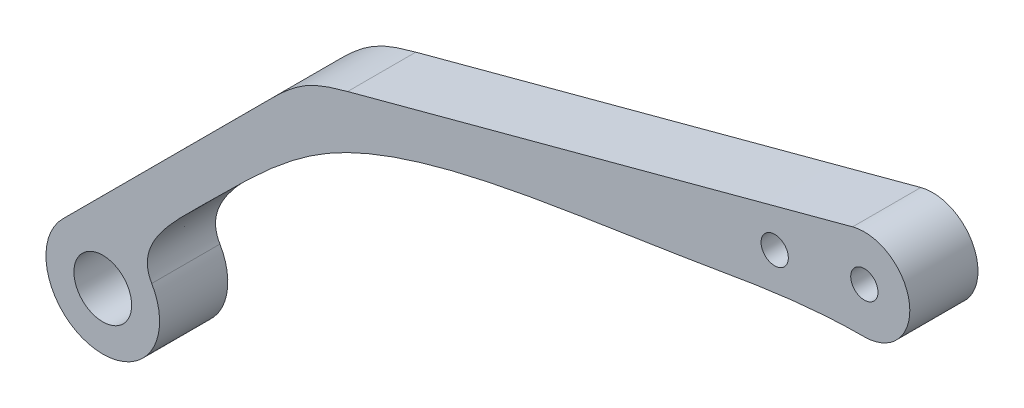
ISO-10303-21;
HEADER;
FILE_DESCRIPTION(('STEP AP214'),'2;1');
FILE_NAME('part.step','',(''),(''),'','','');
FILE_SCHEMA(('AUTOMOTIVE_DESIGN { 1 0 10303 214 1 1 1 1 }'));
ENDSEC;
DATA;
#1=APPLICATION_CONTEXT('core data for automotive mechanical design processes');
#2=APPLICATION_PROTOCOL_DEFINITION('international standard','automotive_design',2000,#1);
#3=PRODUCT_CONTEXT('',#1,'mechanical');
#4=PRODUCT('Part','Part','',(#3));
#5=PRODUCT_RELATED_PRODUCT_CATEGORY('part','',(#4));
#6=PRODUCT_DEFINITION_FORMATION('','',#4);
#7=PRODUCT_DEFINITION_CONTEXT('part definition',#1,'design');
#8=PRODUCT_DEFINITION('design','',#6,#7);
#9=PRODUCT_DEFINITION_SHAPE('','',#8);
#10=(LENGTH_UNIT() NAMED_UNIT(*) SI_UNIT(.MILLI.,.METRE.));
#11=(NAMED_UNIT(*) PLANE_ANGLE_UNIT() SI_UNIT($,.RADIAN.));
#12=(NAMED_UNIT(*) SI_UNIT($,.STERADIAN.) SOLID_ANGLE_UNIT());
#13=UNCERTAINTY_MEASURE_WITH_UNIT(LENGTH_MEASURE(1.E-05),#10,'distance_accuracy_value','');
#14=(GEOMETRIC_REPRESENTATION_CONTEXT(3) GLOBAL_UNCERTAINTY_ASSIGNED_CONTEXT((#13)) GLOBAL_UNIT_ASSIGNED_CONTEXT((#10,
#11,#12)) REPRESENTATION_CONTEXT('',''));
#15=CARTESIAN_POINT('',(0.,0.,0.));
#16=DIRECTION('',(0.,0.,1.));
#17=DIRECTION('',(1.,0.,0.));
#18=AXIS2_PLACEMENT_3D('',#15,#16,#17);
#19=CARTESIAN_POINT('',(-76.5911335242805,13.6319940195412,30.));
#20=DIRECTION('',(0.,0.,-1.));
#21=DIRECTION('',(-1.,0.,0.));
#22=AXIS2_PLACEMENT_3D('',#19,#20,#21);
#23=PLANE('',#22);
#24=CARTESIAN_POINT('',(-30.626400399706,59.5911424228049,30.));
#25=CARTESIAN_POINT('',(-45.9467010760841,44.2708417464266,30.));
#26=CARTESIAN_POINT('',(-76.5933203818141,13.6348734043163,30.));
#27=CARTESIAN_POINT('',(-107.229807248376,-17.0112274912854,30.));
#28=CARTESIAN_POINT('',(-122.550800423415,-32.3322206663243,30.));
#29=B_SPLINE_CURVE_WITH_KNOTS('',3,(#24,#25,#26,#27,#28),.UNSPECIFIED.,.F.,.F.,(4,1,4),(0.,
0.499988699911563,1.),.UNSPECIFIED.);
#30=CARTESIAN_POINT('',(-30.626400399706,59.5911424228048,30.));
#31=VERTEX_POINT('',#30);
#32=CARTESIAN_POINT('',(-122.550800423415,-32.3322206663243,30.));
#33=VERTEX_POINT('',#32);
#34=EDGE_CURVE('E152',#31,#33,#29,.T.);
#35=ORIENTED_EDGE('',*,*,#34,.T.);
#36=CARTESIAN_POINT('',(-104.873130893751,-50.009890195988,30.));
#37=DIRECTION('',(0.,0.,1.));
#38=DIRECTION('',(1.,0.,0.));
#39=AXIS2_PLACEMENT_3D('',#36,#37,#38);
#40=CIRCLE('',#39,25.);
#41=CARTESIAN_POINT('',(-83.339204173341,-37.309890195988,30.));
#42=VERTEX_POINT('',#41);
#43=EDGE_CURVE('E93',#33,#42,#40,.T.);
#44=ORIENTED_EDGE('',*,*,#43,.T.);
#45=CARTESIAN_POINT('',(-83.339204173341,-37.309890195988,30.));
#46=CARTESIAN_POINT('',(-90.5125364222532,-25.14689720471,30.));
#47=CARTESIAN_POINT('',(-49.8615459724189,14.1608327138689,30.));
#48=CARTESIAN_POINT('',(-9.1538991155294,57.3037306216456,30.));
#49=CARTESIAN_POINT('',(72.2000924684333,78.5734076228648,30.));
#50=CARTESIAN_POINT('',(138.592701601063,87.2530934651155,30.));
#51=CARTESIAN_POINT('',(190.890183976245,96.9766204070543,30.));
#52=CARTESIAN_POINT('',(218.356238545745,99.1069980830279,30.));
#53=CARTESIAN_POINT('',(230.15818869184,99.1069980830279,30.));
#54=B_SPLINE_CURVE_WITH_KNOTS('',3,(#45,#46,#47,#48,#49,#50,#51,#52,#53),.UNSPECIFIED.,.F.,.F.,
(4,1,1,1,1,1,4),(0.,0.118681900705007,0.336630205823315,0.560375042185866,0.771462571875992,
0.902269051589085,1.),.UNSPECIFIED.);
#55=CARTESIAN_POINT('',(230.15818869184,99.1069980830279,30.));
#56=VERTEX_POINT('',#55);
#57=EDGE_CURVE('E106',#42,#56,#54,.T.);
#58=ORIENTED_EDGE('',*,*,#57,.T.);
#59=CARTESIAN_POINT('',(230.15818869184,119.106998083028,30.));
#60=DIRECTION('',(0.,0.,1.));
#61=DIRECTION('',(1.,0.,0.));
#62=AXIS2_PLACEMENT_3D('',#59,#60,#61);
#63=CIRCLE('',#62,20.);
#64=CARTESIAN_POINT('',(224.999584078801,138.430268987467,30.));
#65=VERTEX_POINT('',#64);
#66=EDGE_CURVE('E100',#56,#65,#63,.T.);
#67=ORIENTED_EDGE('',*,*,#66,.T.);
#68=CARTESIAN_POINT('',(224.999584078801,138.430268987467,30.));
#69=CARTESIAN_POINT('',(187.965478026642,128.543520969224,30.));
#70=CARTESIAN_POINT('',(135.576081370507,114.39863999832,30.));
#71=CARTESIAN_POINT('',(61.4931801339287,94.6659010815877,30.));
#72=CARTESIAN_POINT('',(24.4776189885244,84.7071637349029,30.));
#73=CARTESIAN_POINT('',(2.83483316368665,78.908647278838,30.));
#74=B_SPLINE_CURVE_WITH_KNOTS('',3,(#68,#69,#70,#71,#72,#73),.UNSPECIFIED.,.F.,.F.,(4,1,1,4),
(0.,0.500020790406966,0.707747990709848,1.),.UNSPECIFIED.);
#75=CARTESIAN_POINT('',(2.83483316368665,78.908647278838,30.));
#76=VERTEX_POINT('',#75);
#77=EDGE_CURVE('E104',#65,#76,#74,.T.);
#78=ORIENTED_EDGE('',*,*,#77,.T.);
#79=CARTESIAN_POINT('',(2.83483316368666,78.908647278838,30.));
#80=CARTESIAN_POINT('',(-3.43125773311106,77.2298416262597,30.));
#81=CARTESIAN_POINT('',(-16.1546823657781,73.375328866747,30.));
#82=CARTESIAN_POINT('',(-26.1949495654657,64.0225932570451,30.));
#83=CARTESIAN_POINT('',(-30.626400399706,59.5911424228048,30.));
#84=B_SPLINE_CURVE_WITH_KNOTS('',3,(#79,#80,#81,#82,#83),.UNSPECIFIED.,.F.,.F.,(4,1,4),(0.,
0.499999988812143,1.),.UNSPECIFIED.);
#85=EDGE_CURVE('E56',#76,#31,#84,.T.);
#86=ORIENTED_EDGE('',*,*,#85,.T.);
#87=EDGE_LOOP('',(#35,#44,#58,#67,#78,#86));
#88=FACE_BOUND('',#87,.T.);
#89=CARTESIAN_POINT('',(-104.873130893751,-50.009890195988,30.));
#90=DIRECTION('',(0.,0.,1.));
#91=DIRECTION('',(1.,0.,0.));
#92=AXIS2_PLACEMENT_3D('',#89,#90,#91);
#93=CIRCLE('',#92,12.7000000000001);
#94=CARTESIAN_POINT('',(-92.1731308937512,-50.009890195988,30.));
#95=VERTEX_POINT('',#94);
#96=EDGE_CURVE('E163',#95,#95,#93,.T.);
#97=ORIENTED_EDGE('',*,*,#96,.F.);
#98=EDGE_LOOP('',(#97));
#99=FACE_BOUND('',#98,.T.);
#100=CARTESIAN_POINT('',(190.718055772363,112.437971520325,30.));
#101=DIRECTION('',(0.,0.,1.));
#102=DIRECTION('',(1.,0.,0.));
#103=AXIS2_PLACEMENT_3D('',#100,#101,#102);
#104=CIRCLE('',#103,5.99999999999996);
#105=CARTESIAN_POINT('',(196.718055772363,112.437971520325,30.));
#106=VERTEX_POINT('',#105);
#107=EDGE_CURVE('E164',#106,#106,#104,.T.);
#108=ORIENTED_EDGE('',*,*,#107,.F.);
#109=EDGE_LOOP('',(#108));
#110=FACE_BOUND('',#109,.T.);
#111=CARTESIAN_POINT('',(230.15818869184,119.106998083028,30.));
#112=DIRECTION('',(0.,0.,1.));
#113=DIRECTION('',(1.,0.,0.));
#114=AXIS2_PLACEMENT_3D('',#111,#112,#113);
#115=CIRCLE('',#114,6.0000000000001);
#116=CARTESIAN_POINT('',(236.15818869184,119.106998083028,30.));
#117=VERTEX_POINT('',#116);
#118=EDGE_CURVE('E171',#117,#117,#115,.T.);
#119=ORIENTED_EDGE('',*,*,#118,.F.);
#120=EDGE_LOOP('',(#119));
#121=FACE_BOUND('',#120,.T.);
#122=ADVANCED_FACE('F38',(#88,#99,#110,#121),#23,.F.);
#123=CARTESIAN_POINT('',(-76.5911335242805,13.6319940195412,0.));
#124=DIRECTION('',(0.,0.,-1.));
#125=DIRECTION('',(-1.,0.,0.));
#126=AXIS2_PLACEMENT_3D('',#123,#124,#125);
#127=PLANE('',#126);
#128=CARTESIAN_POINT('',(190.718055772363,112.437971520325,0.));
#129=DIRECTION('',(0.,0.,1.));
#130=DIRECTION('',(1.,0.,0.));
#131=AXIS2_PLACEMENT_3D('',#128,#129,#130);
#132=CIRCLE('',#131,5.99999999999996);
#133=CARTESIAN_POINT('',(196.718055772363,112.437971520325,0.));
#134=VERTEX_POINT('',#133);
#135=EDGE_CURVE('E168',#134,#134,#132,.T.);
#136=ORIENTED_EDGE('',*,*,#135,.T.);
#137=EDGE_LOOP('',(#136));
#138=FACE_BOUND('',#137,.T.);
#139=CARTESIAN_POINT('',(-30.626400399706,59.5911424228049,0.));
#140=CARTESIAN_POINT('',(-45.9467010760841,44.2708417464266,0.));
#141=CARTESIAN_POINT('',(-76.5933203818141,13.6348734043163,0.));
#142=CARTESIAN_POINT('',(-107.229807248376,-17.0112274912854,0.));
#143=CARTESIAN_POINT('',(-122.550800423415,-32.3322206663243,0.));
#144=B_SPLINE_CURVE_WITH_KNOTS('',3,(#139,#140,#141,#142,#143),.UNSPECIFIED.,.F.,.F.,(4,1,4),
(0.,0.499988699911563,1.),.UNSPECIFIED.);
#145=CARTESIAN_POINT('',(-30.626400399706,59.5911424228048,0.));
#146=VERTEX_POINT('',#145);
#147=CARTESIAN_POINT('',(-122.550800423415,-32.3322206663243,0.));
#148=VERTEX_POINT('',#147);
#149=EDGE_CURVE('E167',#146,#148,#144,.T.);
#150=ORIENTED_EDGE('',*,*,#149,.F.);
#151=CARTESIAN_POINT('',(2.83483316368666,78.908647278838,0.));
#152=CARTESIAN_POINT('',(-3.43125773311106,77.2298416262597,0.));
#153=CARTESIAN_POINT('',(-16.1546823657781,73.375328866747,0.));
#154=CARTESIAN_POINT('',(-26.1949495654657,64.0225932570451,0.));
#155=CARTESIAN_POINT('',(-30.626400399706,59.5911424228048,0.));
#156=B_SPLINE_CURVE_WITH_KNOTS('',3,(#151,#152,#153,#154,#155),.UNSPECIFIED.,.F.,.F.,(4,1,4),
(0.,0.499999988812143,1.),.UNSPECIFIED.);
#157=CARTESIAN_POINT('',(2.83483316368665,78.908647278838,0.));
#158=VERTEX_POINT('',#157);
#159=EDGE_CURVE('E85',#158,#146,#156,.T.);
#160=ORIENTED_EDGE('',*,*,#159,.F.);
#161=CARTESIAN_POINT('',(224.999584078801,138.430268987467,0.));
#162=CARTESIAN_POINT('',(187.965478026642,128.543520969224,0.));
#163=CARTESIAN_POINT('',(135.576081370507,114.39863999832,0.));
#164=CARTESIAN_POINT('',(61.4931801339287,94.6659010815877,0.));
#165=CARTESIAN_POINT('',(24.4776189885244,84.7071637349029,0.));
#166=CARTESIAN_POINT('',(2.83483316368665,78.908647278838,0.));
#167=B_SPLINE_CURVE_WITH_KNOTS('',3,(#161,#162,#163,#164,#165,#166),.UNSPECIFIED.,.F.,.F.,(4,1,
1,4),(0.,0.500020790406966,0.707747990709848,1.),.UNSPECIFIED.);
#168=CARTESIAN_POINT('',(224.999584078801,138.430268987467,0.));
#169=VERTEX_POINT('',#168);
#170=EDGE_CURVE('E79',#169,#158,#167,.T.);
#171=ORIENTED_EDGE('',*,*,#170,.F.);
#172=CARTESIAN_POINT('',(230.15818869184,119.106998083028,0.));
#173=DIRECTION('',(0.,0.,1.));
#174=DIRECTION('',(1.,0.,0.));
#175=AXIS2_PLACEMENT_3D('',#172,#173,#174);
#176=CIRCLE('',#175,20.);
#177=CARTESIAN_POINT('',(230.15818869184,99.1069980830279,0.));
#178=VERTEX_POINT('',#177);
#179=EDGE_CURVE('E114',#178,#169,#176,.T.);
#180=ORIENTED_EDGE('',*,*,#179,.F.);
#181=CARTESIAN_POINT('',(-83.339204173341,-37.309890195988,0.));
#182=CARTESIAN_POINT('',(-90.5125364222532,-25.14689720471,0.));
#183=CARTESIAN_POINT('',(-49.8615459724189,14.1608327138689,0.));
#184=CARTESIAN_POINT('',(-9.1538991155294,57.3037306216456,0.));
#185=CARTESIAN_POINT('',(72.2000924684333,78.5734076228648,0.));
#186=CARTESIAN_POINT('',(138.592701601063,87.2530934651155,0.));
#187=CARTESIAN_POINT('',(190.890183976245,96.9766204070543,0.));
#188=CARTESIAN_POINT('',(218.356238545745,99.1069980830279,0.));
#189=CARTESIAN_POINT('',(230.15818869184,99.1069980830279,0.));
#190=B_SPLINE_CURVE_WITH_KNOTS('',3,(#181,#182,#183,#184,#185,#186,#187,#188,#189),
.UNSPECIFIED.,.F.,.F.,(4,1,1,1,1,1,4),(0.,0.118681900705007,0.336630205823315,0.560375042185866,
0.771462571875992,0.902269051589085,1.),.UNSPECIFIED.);
#191=CARTESIAN_POINT('',(-83.339204173341,-37.309890195988,0.));
#192=VERTEX_POINT('',#191);
#193=EDGE_CURVE('E274',#192,#178,#190,.T.);
#194=ORIENTED_EDGE('',*,*,#193,.F.);
#195=CARTESIAN_POINT('',(-104.873130893751,-50.009890195988,0.));
#196=DIRECTION('',(0.,0.,1.));
#197=DIRECTION('',(1.,0.,0.));
#198=AXIS2_PLACEMENT_3D('',#195,#196,#197);
#199=CIRCLE('',#198,25.);
#200=EDGE_CURVE('E273',#148,#192,#199,.T.);
#201=ORIENTED_EDGE('',*,*,#200,.F.);
#202=EDGE_LOOP('',(#150,#160,#171,#180,#194,#201));
#203=FACE_BOUND('',#202,.T.);
#204=CARTESIAN_POINT('',(-104.873130893751,-50.009890195988,0.));
#205=DIRECTION('',(0.,0.,1.));
#206=DIRECTION('',(1.,0.,0.));
#207=AXIS2_PLACEMENT_3D('',#204,#205,#206);
#208=CIRCLE('',#207,12.7000000000001);
#209=CARTESIAN_POINT('',(-92.1731308937512,-50.009890195988,0.));
#210=VERTEX_POINT('',#209);
#211=EDGE_CURVE('E157',#210,#210,#208,.T.);
#212=ORIENTED_EDGE('',*,*,#211,.T.);
#213=EDGE_LOOP('',(#212));
#214=FACE_BOUND('',#213,.T.);
#215=CARTESIAN_POINT('',(230.15818869184,119.106998083028,0.));
#216=DIRECTION('',(0.,0.,1.));
#217=DIRECTION('',(1.,0.,0.));
#218=AXIS2_PLACEMENT_3D('',#215,#216,#217);
#219=CIRCLE('',#218,6.0000000000001);
#220=CARTESIAN_POINT('',(236.15818869184,119.106998083028,0.));
#221=VERTEX_POINT('',#220);
#222=EDGE_CURVE('E174',#221,#221,#219,.T.);
#223=ORIENTED_EDGE('',*,*,#222,.T.);
#224=EDGE_LOOP('',(#223));
#225=FACE_BOUND('',#224,.T.);
#226=ADVANCED_FACE('F184',(#138,#203,#214,#225),#127,.T.);
#227=DIRECTION('',(0.,0.,-1.));
#228=VECTOR('',#227,1.);
#229=SURFACE_OF_LINEAR_EXTRUSION('',#29,#228);
#230=ORIENTED_EDGE('',*,*,#149,.T.);
#231=DIRECTION('',(0.,0.,-1.));
#232=VECTOR('',#231,1.);
#233=CARTESIAN_POINT('',(-122.550800423415,-32.3322206663243,30.));
#234=LINE('',#233,#232);
#235=EDGE_CURVE('E11',#33,#148,#234,.T.);
#236=ORIENTED_EDGE('',*,*,#235,.F.);
#237=ORIENTED_EDGE('',*,*,#34,.F.);
#238=DIRECTION('',(0.,0.,-1.));
#239=VECTOR('',#238,1.);
#240=CARTESIAN_POINT('',(-30.626400399706,59.5911424228048,30.));
#241=LINE('',#240,#239);
#242=EDGE_CURVE('E120',#31,#146,#241,.T.);
#243=ORIENTED_EDGE('',*,*,#242,.T.);
#244=EDGE_LOOP('',(#230,#236,#237,#243));
#245=FACE_BOUND('',#244,.T.);
#246=ADVANCED_FACE('F40',(#245),#229,.F.);
#247=CARTESIAN_POINT('',(-104.873130893751,-50.009890195988,30.));
#248=DIRECTION('',(0.,0.,-1.));
#249=DIRECTION('',(-1.,0.,0.));
#250=AXIS2_PLACEMENT_3D('',#247,#248,#249);
#251=CYLINDRICAL_SURFACE('',#250,25.);
#252=ORIENTED_EDGE('',*,*,#200,.T.);
#253=DIRECTION('',(0.,0.,-1.));
#254=VECTOR('',#253,1.);
#255=CARTESIAN_POINT('',(-83.339204173341,-37.309890195988,30.));
#256=LINE('',#255,#254);
#257=EDGE_CURVE('E48',#42,#192,#256,.T.);
#258=ORIENTED_EDGE('',*,*,#257,.F.);
#259=ORIENTED_EDGE('',*,*,#43,.F.);
#260=ORIENTED_EDGE('',*,*,#235,.T.);
#261=EDGE_LOOP('',(#252,#258,#259,#260));
#262=FACE_BOUND('',#261,.T.);
#263=ADVANCED_FACE('F143',(#262),#251,.T.);
#264=DIRECTION('',(0.,0.,-1.));
#265=VECTOR('',#264,1.);
#266=SURFACE_OF_LINEAR_EXTRUSION('',#54,#265);
#267=ORIENTED_EDGE('',*,*,#193,.T.);
#268=DIRECTION('',(0.,0.,-1.));
#269=VECTOR('',#268,1.);
#270=CARTESIAN_POINT('',(230.15818869184,99.1069980830279,30.));
#271=LINE('',#270,#269);
#272=EDGE_CURVE('E115',#56,#178,#271,.T.);
#273=ORIENTED_EDGE('',*,*,#272,.F.);
#274=ORIENTED_EDGE('',*,*,#57,.F.);
#275=ORIENTED_EDGE('',*,*,#257,.T.);
#276=EDGE_LOOP('',(#267,#273,#274,#275));
#277=FACE_BOUND('',#276,.T.);
#278=ADVANCED_FACE('F141',(#277),#266,.F.);
#279=CARTESIAN_POINT('',(230.15818869184,119.106998083028,30.));
#280=DIRECTION('',(0.,0.,-1.));
#281=DIRECTION('',(-1.,0.,0.));
#282=AXIS2_PLACEMENT_3D('',#279,#280,#281);
#283=CYLINDRICAL_SURFACE('',#282,20.);
#284=ORIENTED_EDGE('',*,*,#179,.T.);
#285=DIRECTION('',(0.,0.,-1.));
#286=VECTOR('',#285,1.);
#287=CARTESIAN_POINT('',(224.999584078801,138.430268987467,30.));
#288=LINE('',#287,#286);
#289=EDGE_CURVE('E111',#65,#169,#288,.T.);
#290=ORIENTED_EDGE('',*,*,#289,.F.);
#291=ORIENTED_EDGE('',*,*,#66,.F.);
#292=ORIENTED_EDGE('',*,*,#272,.T.);
#293=EDGE_LOOP('',(#284,#290,#291,#292));
#294=FACE_BOUND('',#293,.T.);
#295=ADVANCED_FACE('F112',(#294),#283,.T.);
#296=DIRECTION('',(0.,0.,-1.));
#297=VECTOR('',#296,1.);
#298=SURFACE_OF_LINEAR_EXTRUSION('',#74,#297);
#299=ORIENTED_EDGE('',*,*,#170,.T.);
#300=DIRECTION('',(0.,0.,-1.));
#301=VECTOR('',#300,1.);
#302=CARTESIAN_POINT('',(2.83483316368665,78.908647278838,30.));
#303=LINE('',#302,#301);
#304=EDGE_CURVE('E116',#76,#158,#303,.T.);
#305=ORIENTED_EDGE('',*,*,#304,.F.);
#306=ORIENTED_EDGE('',*,*,#77,.F.);
#307=ORIENTED_EDGE('',*,*,#289,.T.);
#308=EDGE_LOOP('',(#299,#305,#306,#307));
#309=FACE_BOUND('',#308,.T.);
#310=ADVANCED_FACE('F118',(#309),#298,.F.);
#311=DIRECTION('',(0.,0.,-1.));
#312=VECTOR('',#311,1.);
#313=SURFACE_OF_LINEAR_EXTRUSION('',#84,#312);
#314=ORIENTED_EDGE('',*,*,#159,.T.);
#315=ORIENTED_EDGE('',*,*,#242,.F.);
#316=ORIENTED_EDGE('',*,*,#85,.F.);
#317=ORIENTED_EDGE('',*,*,#304,.T.);
#318=EDGE_LOOP('',(#314,#315,#316,#317));
#319=FACE_BOUND('',#318,.T.);
#320=ADVANCED_FACE('F137',(#319),#313,.F.);
#321=CARTESIAN_POINT('',(-104.873130893751,-50.009890195988,30.));
#322=DIRECTION('',(0.,0.,-1.));
#323=DIRECTION('',(-1.,0.,0.));
#324=AXIS2_PLACEMENT_3D('',#321,#322,#323);
#325=CYLINDRICAL_SURFACE('',#324,12.7000000000001);
#326=ORIENTED_EDGE('',*,*,#96,.T.);
#327=EDGE_LOOP('',(#326));
#328=FACE_BOUND('',#327,.T.);
#329=ORIENTED_EDGE('',*,*,#211,.F.);
#330=EDGE_LOOP('',(#329));
#331=FACE_BOUND('',#330,.T.);
#332=ADVANCED_FACE('F191',(#328,#331),#325,.F.);
#333=CARTESIAN_POINT('',(190.718055772363,112.437971520325,30.));
#334=DIRECTION('',(0.,0.,-1.));
#335=DIRECTION('',(-1.,0.,0.));
#336=AXIS2_PLACEMENT_3D('',#333,#334,#335);
#337=CYLINDRICAL_SURFACE('',#336,5.99999999999996);
#338=ORIENTED_EDGE('',*,*,#107,.T.);
#339=EDGE_LOOP('',(#338));
#340=FACE_BOUND('',#339,.T.);
#341=ORIENTED_EDGE('',*,*,#135,.F.);
#342=EDGE_LOOP('',(#341));
#343=FACE_BOUND('',#342,.T.);
#344=ADVANCED_FACE('F194',(#340,#343),#337,.F.);
#345=CARTESIAN_POINT('',(230.15818869184,119.106998083028,30.));
#346=DIRECTION('',(0.,0.,-1.));
#347=DIRECTION('',(-1.,0.,0.));
#348=AXIS2_PLACEMENT_3D('',#345,#346,#347);
#349=CYLINDRICAL_SURFACE('',#348,6.0000000000001);
#350=ORIENTED_EDGE('',*,*,#118,.T.);
#351=EDGE_LOOP('',(#350));
#352=FACE_BOUND('',#351,.T.);
#353=ORIENTED_EDGE('',*,*,#222,.F.);
#354=EDGE_LOOP('',(#353));
#355=FACE_BOUND('',#354,.T.);
#356=ADVANCED_FACE('F180',(#352,#355),#349,.F.);
#357=CLOSED_SHELL('',(#122,#226,#246,#263,#278,#295,#310,#320,#332,#344,#356));
#358=MANIFOLD_SOLID_BREP('B2',#357);
#359=ADVANCED_BREP_SHAPE_REPRESENTATION('',(#18,#358),#14);
#360=SHAPE_DEFINITION_REPRESENTATION(#9,#359);
ENDSEC;
END-ISO-10303-21;
